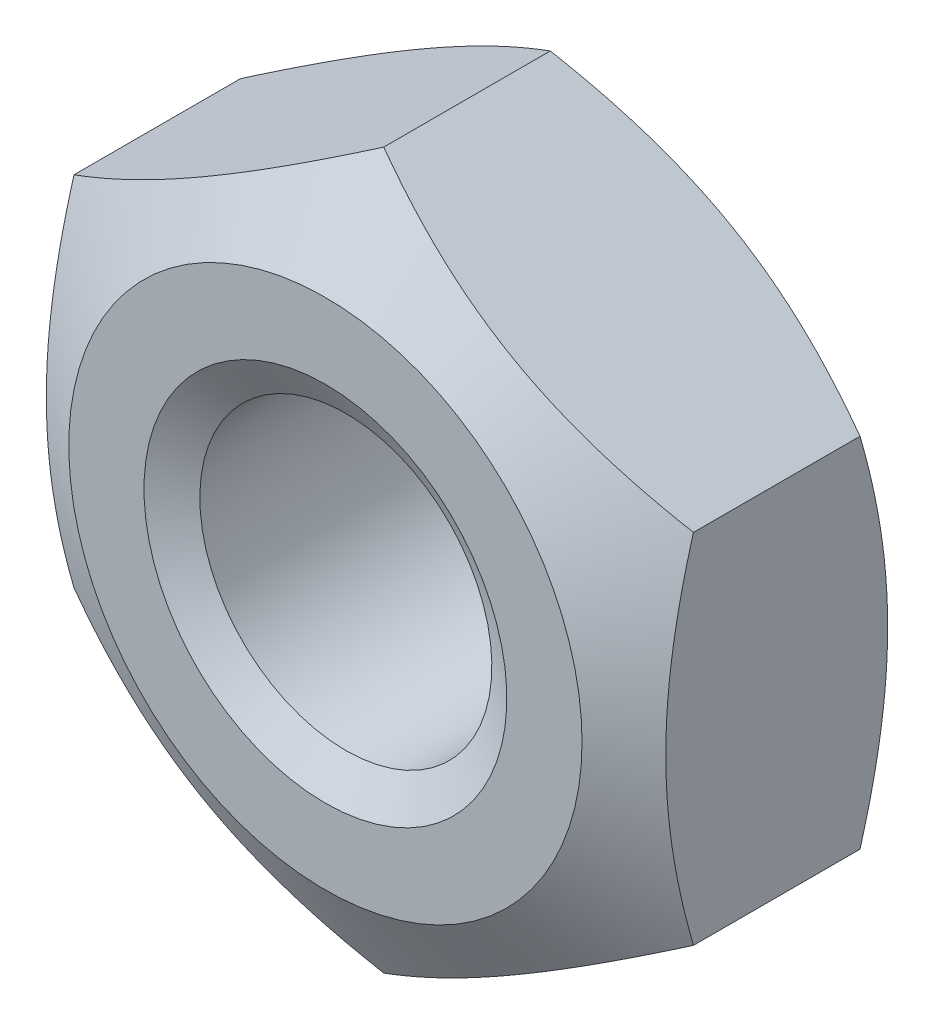
ISO-10303-21;
HEADER;
FILE_DESCRIPTION(('STEP AP214'),'2;1');
FILE_NAME('part.step','',(''),(''),'','','');
FILE_SCHEMA(('AUTOMOTIVE_DESIGN { 1 0 10303 214 1 1 1 1 }'));
ENDSEC;
DATA;
#1=APPLICATION_CONTEXT('core data for automotive mechanical design processes');
#2=APPLICATION_PROTOCOL_DEFINITION('international standard','automotive_design',2000,#1);
#3=PRODUCT_CONTEXT('',#1,'mechanical');
#4=PRODUCT('Part','Part','',(#3));
#5=PRODUCT_RELATED_PRODUCT_CATEGORY('part','',(#4));
#6=PRODUCT_DEFINITION_FORMATION('','',#4);
#7=PRODUCT_DEFINITION_CONTEXT('part definition',#1,'design');
#8=PRODUCT_DEFINITION('design','',#6,#7);
#9=PRODUCT_DEFINITION_SHAPE('','',#8);
#10=(LENGTH_UNIT() NAMED_UNIT(*) SI_UNIT(.MILLI.,.METRE.));
#11=(NAMED_UNIT(*) PLANE_ANGLE_UNIT() SI_UNIT($,.RADIAN.));
#12=(NAMED_UNIT(*) SI_UNIT($,.STERADIAN.) SOLID_ANGLE_UNIT());
#13=UNCERTAINTY_MEASURE_WITH_UNIT(LENGTH_MEASURE(1.E-05),#10,'distance_accuracy_value','');
#14=(GEOMETRIC_REPRESENTATION_CONTEXT(3) GLOBAL_UNCERTAINTY_ASSIGNED_CONTEXT((#13)) GLOBAL_UNIT_ASSIGNED_CONTEXT((#10,
#11,#12)) REPRESENTATION_CONTEXT('',''));
#15=CARTESIAN_POINT('',(0.,0.,0.));
#16=DIRECTION('',(0.,0.,1.));
#17=DIRECTION('',(1.,0.,0.));
#18=AXIS2_PLACEMENT_3D('',#15,#16,#17);
#19=CARTESIAN_POINT('',(0.,0.,0.));
#20=DIRECTION('',(0.,0.,1.));
#21=DIRECTION('',(1.,0.,0.));
#22=AXIS2_PLACEMENT_3D('',#19,#20,#21);
#23=PLANE('',#22);
#24=CARTESIAN_POINT('',(0.,0.,0.));
#25=DIRECTION('',(0.,0.,1.));
#26=DIRECTION('',(0.,-1.,0.));
#27=AXIS2_PLACEMENT_3D('',#24,#25,#26);
#28=CIRCLE('',#27,2.05);
#29=CARTESIAN_POINT('',(0.,-2.05,0.));
#30=VERTEX_POINT('',#29);
#31=EDGE_CURVE('E265',#30,#30,#28,.T.);
#32=ORIENTED_EDGE('',*,*,#31,.F.);
#33=EDGE_LOOP('',(#32));
#34=FACE_BOUND('',#33,.T.);
#35=CARTESIAN_POINT('',(0.,0.,0.));
#36=DIRECTION('',(0.,0.,1.));
#37=DIRECTION('',(1.,0.,0.));
#38=AXIS2_PLACEMENT_3D('',#35,#36,#37);
#39=CIRCLE('',#38,2.9);
#40=CARTESIAN_POINT('',(2.9,0.,0.));
#41=VERTEX_POINT('',#40);
#42=EDGE_CURVE('E224',#41,#41,#39,.T.);
#43=ORIENTED_EDGE('',*,*,#42,.T.);
#44=EDGE_LOOP('',(#43));
#45=FACE_BOUND('',#44,.T.);
#46=ADVANCED_FACE('F37',(#34,#45),#23,.T.);
#47=CARTESIAN_POINT('',(0.,0.,0.));
#48=DIRECTION('',(0.,0.,-1.));
#49=DIRECTION('',(-1.,0.,0.));
#50=AXIS2_PLACEMENT_3D('',#47,#48,#49);
#51=CONICAL_SURFACE('',#50,2.9,1.0471975511966);
#52=CARTESIAN_POINT('',(-3.50020000000001,2.02061047210984,-0.659084222207149));
#53=CARTESIAN_POINT('',(-3.34639282154756,2.10941108799266,-0.607795950503762));
#54=CARTESIAN_POINT('',(-3.19125798916559,2.19897822522908,-0.561151115329975));
#55=CARTESIAN_POINT('',(-2.87830199342323,2.37966345361544,-0.479732037047126));
#56=CARTESIAN_POINT('',(-2.72047526921251,2.47078475532381,-0.444986597098339));
#57=CARTESIAN_POINT('',(-2.40677778961988,2.65189807961073,-0.390900188696613));
#58=CARTESIAN_POINT('',(-2.25095530083932,2.74186223545398,-0.371199247774158));
#59=CARTESIAN_POINT('',(-1.93857711279464,2.92221386641055,-0.34768029425103));
#60=CARTESIAN_POINT('',(-1.78202254896578,3.01260068598001,-0.343842806059341));
#61=CARTESIAN_POINT('',(-1.48949078007902,3.18149398149329,-0.351825463390753));
#62=CARTESIAN_POINT('',(-1.3534697875421,3.26002573814992,-0.361685595583383));
#63=CARTESIAN_POINT('',(-1.08231397971102,3.41657761679353,-0.392936628413179));
#64=CARTESIAN_POINT('',(-0.947180102315328,3.49459719728457,-0.414338204799573));
#65=CARTESIAN_POINT('',(-0.675465207594828,3.65147186489428,-0.467840569394352));
#66=CARTESIAN_POINT('',(-0.538918580721677,3.73030709667643,-0.500168155958861));
#67=CARTESIAN_POINT('',(-0.267861907055511,3.88680174018324,-0.573539095321768));
#68=CARTESIAN_POINT('',(-0.133348387531477,3.96446315689008,-0.614565208083641));
#69=CARTESIAN_POINT('',(0.000199999999986187,4.04156735438121,-0.659084222207145));
#70=B_SPLINE_CURVE_WITH_KNOTS('',3,(#52,#53,#54,#55,#56,#57,#58,#59,#60,#61,#62,#63,#64,#65,#66,
#67,#68,#69),.UNSPECIFIED.,.F.,.F.,(4,2,2,2,2,2,2,2,4),(0.,0.554793832886255,1.11092123814984,
1.65328467083219,2.19498204478403,2.6666513085086,3.13875761298267,3.6213361260051,
4.10296698719187),.UNSPECIFIED.);
#71=CARTESIAN_POINT('',(-3.5,2.02072594216369,-0.659017552683417));
#72=VERTEX_POINT('',#71);
#73=CARTESIAN_POINT('',(0.,4.04145188432738,-0.659017552683417));
#74=VERTEX_POINT('',#73);
#75=EDGE_CURVE('E219',#72,#74,#70,.T.);
#76=ORIENTED_EDGE('',*,*,#75,.F.);
#77=CARTESIAN_POINT('',(-3.50000000000001,-5.31136483673784,-1.99813101628422));
#78=CARTESIAN_POINT('',(-3.50000000000001,-5.15942090242245,-1.92490121468986));
#79=CARTESIAN_POINT('',(-3.50000000000001,-5.00711533370036,-1.85240822887569));
#80=CARTESIAN_POINT('',(-3.50000000000001,-4.70158810322329,-1.70931288720086));
#81=CARTESIAN_POINT('',(-3.50000000000001,-4.54836629015752,-1.63871085479051));
#82=CARTESIAN_POINT('',(-3.50000000000001,-4.23996688822228,-1.4994338768294));
#83=CARTESIAN_POINT('',(-3.50000000000001,-4.08478310281085,-1.43077260224771));
#84=CARTESIAN_POINT('',(-3.50000000000001,-3.77313949355462,-1.29642081556093));
#85=CARTESIAN_POINT('',(-3.50000000000001,-3.61667973418189,-1.23073015444182));
#86=CARTESIAN_POINT('',(-3.50000000000001,-3.29768531174892,-1.10126128807796));
#87=CARTESIAN_POINT('',(-3.50000000000001,-3.13510572183041,-1.03759314345185));
#88=CARTESIAN_POINT('',(-3.50000000000001,-2.80800197247078,-0.915364021417356));
#89=CARTESIAN_POINT('',(-3.50000000000001,-2.64347759131592,-0.856803632815379));
#90=CARTESIAN_POINT('',(-3.50000000000001,-2.31257010807294,-0.74641323862502));
#91=CARTESIAN_POINT('',(-3.50000000000001,-2.14619196139842,-0.694568534709308));
#92=CARTESIAN_POINT('',(-3.50000000000001,-1.81105343313581,-0.599349171371076));
#93=CARTESIAN_POINT('',(-3.50000000000001,-1.64229385723014,-0.555971717651678));
#94=CARTESIAN_POINT('',(-3.50000000000001,-1.30319521232889,-0.480063371355623));
#95=CARTESIAN_POINT('',(-3.50000000000001,-1.13286830203993,-0.447479195842798));
#96=CARTESIAN_POINT('',(-3.50000000000001,-0.79022477286612,-0.395081871657864));
#97=CARTESIAN_POINT('',(-3.50000000000001,-0.617908307087577,-0.37526774684645));
#98=CARTESIAN_POINT('',(-3.50000000000001,-0.274345197192189,-0.350251362238807));
#99=CARTESIAN_POINT('',(-3.50000000000001,-0.103111880555402,-0.344870531201222));
#100=CARTESIAN_POINT('',(-3.50000000000001,0.239201330874601,-0.348713485586125));
#101=CARTESIAN_POINT('',(-3.50000000000001,0.41028121928658,-0.357937852613651));
#102=CARTESIAN_POINT('',(-3.50000000000001,0.70429519265999,-0.385707915406696));
#103=CARTESIAN_POINT('',(-3.50000000000001,0.827552756549975,-0.400999335346644));
#104=CARTESIAN_POINT('',(-3.50000000000001,1.073081965004,-0.438145456330363));
#105=CARTESIAN_POINT('',(-3.50000000000001,1.19535345727716,-0.460001151969546));
#106=CARTESIAN_POINT('',(-3.50000000000001,1.56057228529969,-0.53425672689792));
#107=CARTESIAN_POINT('',(-3.50000000000001,1.80177155667069,-0.595328878881682));
#108=CARTESIAN_POINT('',(-3.50000000000001,2.16232569526209,-0.70017140308527));
#109=CARTESIAN_POINT('',(-3.50000000000001,2.28357348756094,-0.737793809790581));
#110=CARTESIAN_POINT('',(-3.50000000000001,2.52489010665731,-0.816679840125424));
#111=CARTESIAN_POINT('',(-3.50000000000001,2.64495892581726,-0.857943487326186));
#112=CARTESIAN_POINT('',(-3.50000000000001,2.88396125133164,-0.943472145917674));
#113=CARTESIAN_POINT('',(-3.50000000000001,3.00289517396904,-0.987736004433427));
#114=CARTESIAN_POINT('',(-3.50000000000001,3.23979550184552,-1.07877130209366));
#115=CARTESIAN_POINT('',(-3.50000000000001,3.35776191637186,-1.12554271713519));
#116=CARTESIAN_POINT('',(-3.50000000000001,3.62720966858019,-1.23515214584308));
#117=CARTESIAN_POINT('',(-3.50000000000001,3.77840595445805,-1.29868951541557));
#118=CARTESIAN_POINT('',(-3.50000000000001,4.07960382759664,-1.42854148860491));
#119=CARTESIAN_POINT('',(-3.50000000000001,4.22960535759355,-1.49485622439695));
#120=CARTESIAN_POINT('',(-3.50000000000001,4.67815880312762,-1.6971372832275));
#121=CARTESIAN_POINT('',(-3.50000000000001,4.97521308173916,-1.83642112459514));
#122=CARTESIAN_POINT('',(-3.50000000000001,5.56674529590108,-2.12094682913322));
#123=CARTESIAN_POINT('',(-3.50000000000001,5.86122075568393,-2.26619378792242));
#124=CARTESIAN_POINT('',(-3.50000000000001,6.44813760950686,-2.56075420943249));
#125=CARTESIAN_POINT('',(-3.50000000000001,6.74057893842578,-2.71006780159818));
#126=CARTESIAN_POINT('',(-3.50000000000001,7.30109720136647,-2.99978756420686));
#127=CARTESIAN_POINT('',(-3.50000000000001,7.56928762666126,-3.1399748724395));
#128=CARTESIAN_POINT('',(-3.50000000000001,8.10469000797172,-3.42222223815564));
#129=CARTESIAN_POINT('',(-3.50000000000001,8.37190193564299,-3.56428234934926));
#130=CARTESIAN_POINT('',(-3.50000000000001,8.90498527599219,-3.84953363937058));
#131=CARTESIAN_POINT('',(-3.50000000000001,9.17085833346865,-3.99272174872152));
#132=CARTESIAN_POINT('',(-3.50000000000001,9.70197403805375,-4.2802329515213));
#133=CARTESIAN_POINT('',(-3.50000000000001,9.96721671443289,-4.424555990876));
#134=CARTESIAN_POINT('',(-3.50000000000001,10.2322248103912,-4.56930561963763));
#135=B_SPLINE_CURVE_WITH_KNOTS('',3,(#77,#78,#79,#80,#81,#82,#83,#84,#85,#86,#87,#88,#89,#90,
#91,#92,#93,#94,#95,#96,#97,#98,#99,#100,#101,#102,#103,#104,#105,#106,#107,#108,#109,#110,#111,
#112,#113,#114,#115,#116,#117,#118,#119,#120,#121,#122,#123,#124,#125,#126,#127,#128,#129,#130,
#131,#132,#133,#134),.UNSPECIFIED.,.F.,.F.,(4,2,2,2,2,2,2,2,2,2,2,2,2,2,2,2,2,2,2,2,2,2,2,2,2,2,
2,2,4),(0.,0.506016733737126,1.01211947662582,1.52117948842461,2.03021393600136,
2.55395280437168,3.07775196817206,3.60038461534117,4.12284449461688,4.64268532226538,
5.16248640870381,5.67582610483066,6.18918624357403,6.5616107275697,6.93409166847294,
7.67951132389959,8.0603346603271,8.44116046215974,8.82184074678616,9.20251737292057,
9.69449258724899,10.1864912414024,11.1706395360279,12.1556470640961,13.1406859826261,
14.0485359547554,14.9564120200025,15.8623460587302,16.7682371765389),.UNSPECIFIED.);
#136=CARTESIAN_POINT('',(-3.50000000000001,-2.02072594216367,-0.659017552683417));
#137=VERTEX_POINT('',#136);
#138=EDGE_CURVE('E187',#137,#72,#135,.T.);
#139=ORIENTED_EDGE('',*,*,#138,.F.);
#140=CARTESIAN_POINT('',(0.000199999999984311,-4.04156735438123,-0.659084222207153));
#141=CARTESIAN_POINT('',(-0.153607178452466,-3.95276673849841,-0.607795950503765));
#142=CARTESIAN_POINT('',(-0.308742010834441,-3.86319960126199,-0.561151115329979));
#143=CARTESIAN_POINT('',(-0.6216980065768,-3.68251437287563,-0.479732037047132));
#144=CARTESIAN_POINT('',(-0.779524730787515,-3.59139307116726,-0.444986597098345));
#145=CARTESIAN_POINT('',(-1.09322221038015,-3.41027974688035,-0.39090018869662));
#146=CARTESIAN_POINT('',(-1.24904469916071,-3.32031559103709,-0.371199247774166));
#147=CARTESIAN_POINT('',(-1.5614228872054,-3.13996396008052,-0.34768029425104));
#148=CARTESIAN_POINT('',(-1.71797745103425,-3.04957714051107,-0.343842806059352));
#149=CARTESIAN_POINT('',(-2.01050921992101,-2.88068384499778,-0.351825463390765));
#150=CARTESIAN_POINT('',(-2.14653021245793,-2.80215208834115,-0.361685595583395));
#151=CARTESIAN_POINT('',(-2.41768602028901,-2.64560020969755,-0.392936628413191));
#152=CARTESIAN_POINT('',(-2.5528198976847,-2.56758062920651,-0.414338204799586));
#153=CARTESIAN_POINT('',(-2.8245347924052,-2.4107059615968,-0.467840569394365));
#154=CARTESIAN_POINT('',(-2.96108141927835,-2.33187072981465,-0.500168155958875));
#155=CARTESIAN_POINT('',(-3.23213809294451,-2.17537608630785,-0.573539095321781));
#156=CARTESIAN_POINT('',(-3.36665161246855,-2.097714669601,-0.614565208083653));
#157=CARTESIAN_POINT('',(-3.50020000000001,-2.02061047210987,-0.659084222207157));
#158=B_SPLINE_CURVE_WITH_KNOTS('',3,(#140,#141,#142,#143,#144,#145,#146,#147,#148,#149,#150,
#151,#152,#153,#154,#155,#156,#157),.UNSPECIFIED.,.F.,.F.,(4,2,2,2,2,2,2,2,4),(0.,
0.554793832886256,1.11092123814984,1.65328467083219,2.19498204478404,2.6666513085086,
3.13875761298267,3.62133612600509,4.10296698719186),.UNSPECIFIED.);
#159=CARTESIAN_POINT('',(0.,-4.04145188432738,-0.659017552683417));
#160=VERTEX_POINT('',#159);
#161=EDGE_CURVE('E179',#160,#137,#158,.T.);
#162=ORIENTED_EDGE('',*,*,#161,.F.);
#163=CARTESIAN_POINT('',(3.50019999999999,-2.02061047210986,-0.659084222207145));
#164=CARTESIAN_POINT('',(3.34639282154754,-2.10941108799268,-0.607795950503758));
#165=CARTESIAN_POINT('',(3.19125798916557,-2.1989782252291,-0.561151115329971));
#166=CARTESIAN_POINT('',(2.87830199342321,-2.37966345361546,-0.479732037047124));
#167=CARTESIAN_POINT('',(2.72047526921249,-2.47078475532383,-0.444986597098337));
#168=CARTESIAN_POINT('',(2.40677778961986,-2.65189807961075,-0.390900188696612));
#169=CARTESIAN_POINT('',(2.2509553008393,-2.741862235454,-0.371199247774158));
#170=CARTESIAN_POINT('',(1.93857711279461,-2.92221386641057,-0.347680294251031));
#171=CARTESIAN_POINT('',(1.78202254896576,-3.01260068598002,-0.343842806059342));
#172=CARTESIAN_POINT('',(1.489490780079,-3.18149398149331,-0.351825463390755));
#173=CARTESIAN_POINT('',(1.35346978754208,-3.26002573814994,-0.361685595583385));
#174=CARTESIAN_POINT('',(1.08231397971099,-3.41657761679355,-0.392936628413182));
#175=CARTESIAN_POINT('',(0.947180102315304,-3.49459719728458,-0.414338204799577));
#176=CARTESIAN_POINT('',(0.675465207594802,-3.6514718648943,-0.467840569394357));
#177=CARTESIAN_POINT('',(0.53891858072165,-3.73030709667645,-0.500168155958867));
#178=CARTESIAN_POINT('',(0.267861907055483,-3.88680174018325,-0.573539095321775));
#179=CARTESIAN_POINT('',(0.133348387531448,-3.9644631568901,-0.614565208083648));
#180=CARTESIAN_POINT('',(-0.000200000000015813,-4.04156735438123,-0.659084222207153));
#181=B_SPLINE_CURVE_WITH_KNOTS('',3,(#163,#164,#165,#166,#167,#168,#169,#170,#171,#172,#173,
#174,#175,#176,#177,#178,#179,#180),.UNSPECIFIED.,.F.,.F.,(4,2,2,2,2,2,2,2,4),(0.,
0.554793832886253,1.11092123814984,1.65328467083219,2.19498204478403,2.6666513085086,
3.13875761298267,3.6213361260051,4.10296698719188),.UNSPECIFIED.);
#182=CARTESIAN_POINT('',(3.49999999999999,-2.0207259421637,-0.659017552683417));
#183=VERTEX_POINT('',#182);
#184=EDGE_CURVE('E95',#183,#160,#181,.T.);
#185=ORIENTED_EDGE('',*,*,#184,.F.);
#186=CARTESIAN_POINT('',(3.49999999999999,-5.31136483673782,-1.9981310162842));
#187=CARTESIAN_POINT('',(3.49999999999999,-5.15942090242243,-1.92490121468984));
#188=CARTESIAN_POINT('',(3.49999999999999,-5.00711533370034,-1.85240822887567));
#189=CARTESIAN_POINT('',(3.49999999999999,-4.70158810322327,-1.70931288720084));
#190=CARTESIAN_POINT('',(3.49999999999999,-4.5483662901575,-1.63871085479049));
#191=CARTESIAN_POINT('',(3.49999999999999,-4.23996688822227,-1.49943387682938));
#192=CARTESIAN_POINT('',(3.49999999999999,-4.08478310281084,-1.43077260224769));
#193=CARTESIAN_POINT('',(3.49999999999999,-3.77313949355461,-1.29642081556092));
#194=CARTESIAN_POINT('',(3.49999999999999,-3.61667973418188,-1.23073015444181));
#195=CARTESIAN_POINT('',(3.49999999999999,-3.29768531174891,-1.10126128807795));
#196=CARTESIAN_POINT('',(3.49999999999999,-3.1351057218304,-1.03759314345183));
#197=CARTESIAN_POINT('',(3.49999999999999,-2.80800197247077,-0.915364021417344));
#198=CARTESIAN_POINT('',(3.49999999999999,-2.64347759131591,-0.856803632815367));
#199=CARTESIAN_POINT('',(3.49999999999999,-2.31257010807293,-0.746413238625008));
#200=CARTESIAN_POINT('',(3.49999999999999,-2.14619196139841,-0.694568534709296));
#201=CARTESIAN_POINT('',(3.49999999999999,-1.8110534331358,-0.599349171371064));
#202=CARTESIAN_POINT('',(3.49999999999999,-1.64229385723014,-0.555971717651666));
#203=CARTESIAN_POINT('',(3.49999999999999,-1.30319521232888,-0.480063371355612));
#204=CARTESIAN_POINT('',(3.49999999999999,-1.13286830203993,-0.447479195842786));
#205=CARTESIAN_POINT('',(3.49999999999999,-0.790224772866121,-0.395081871657852));
#206=CARTESIAN_POINT('',(3.49999999999999,-0.617908307087578,-0.375267746846438));
#207=CARTESIAN_POINT('',(3.49999999999999,-0.274345197192193,-0.350251362238795));
#208=CARTESIAN_POINT('',(3.49999999999999,-0.103111880555407,-0.34487053120121));
#209=CARTESIAN_POINT('',(3.49999999999999,0.239201330874594,-0.348713485586112));
#210=CARTESIAN_POINT('',(3.49999999999999,0.410281219286572,-0.357937852613639));
#211=CARTESIAN_POINT('',(3.49999999999999,0.704295192659981,-0.385707915406683));
#212=CARTESIAN_POINT('',(3.49999999999999,0.827552756549966,-0.400999335346631));
#213=CARTESIAN_POINT('',(3.49999999999999,1.07308196500399,-0.438145456330349));
#214=CARTESIAN_POINT('',(3.49999999999999,1.19535345727715,-0.460001151969533));
#215=CARTESIAN_POINT('',(3.49999999999999,1.56057228529967,-0.534256726897906));
#216=CARTESIAN_POINT('',(3.49999999999999,1.80177155667067,-0.595328878881667));
#217=CARTESIAN_POINT('',(3.49999999999999,2.16232569526207,-0.700171403085254));
#218=CARTESIAN_POINT('',(3.49999999999999,2.28357348756092,-0.737793809790564));
#219=CARTESIAN_POINT('',(3.49999999999999,2.52489010665729,-0.816679840125407));
#220=CARTESIAN_POINT('',(3.49999999999999,2.64495892581724,-0.857943487326168));
#221=CARTESIAN_POINT('',(3.49999999999999,2.88396125133162,-0.943472145917656));
#222=CARTESIAN_POINT('',(3.49999999999999,3.00289517396902,-0.987736004433409));
#223=CARTESIAN_POINT('',(3.49999999999999,3.2397955018455,-1.07877130209364));
#224=CARTESIAN_POINT('',(3.49999999999999,3.35776191637183,-1.12554271713517));
#225=CARTESIAN_POINT('',(3.49999999999999,3.62720966858016,-1.23515214584306));
#226=CARTESIAN_POINT('',(3.49999999999999,3.77840595445802,-1.29868951541555));
#227=CARTESIAN_POINT('',(3.49999999999999,4.07960382759661,-1.42854148860489));
#228=CARTESIAN_POINT('',(3.49999999999999,4.22960535759352,-1.49485622439693));
#229=CARTESIAN_POINT('',(3.49999999999999,4.67815880312759,-1.69713728322748));
#230=CARTESIAN_POINT('',(3.49999999999999,4.97521308173913,-1.83642112459512));
#231=CARTESIAN_POINT('',(3.49999999999999,5.56674529590105,-2.12094682913319));
#232=CARTESIAN_POINT('',(3.49999999999999,5.86122075568389,-2.2661937879224));
#233=CARTESIAN_POINT('',(3.49999999999999,6.44813760950683,-2.56075420943246));
#234=CARTESIAN_POINT('',(3.49999999999999,6.74057893842575,-2.71006780159815));
#235=CARTESIAN_POINT('',(3.49999999999999,7.30109720136643,-2.99978756420684));
#236=CARTESIAN_POINT('',(3.49999999999999,7.56928762666122,-3.13997487243947));
#237=CARTESIAN_POINT('',(3.49999999999999,8.10469000797167,-3.42222223815561));
#238=CARTESIAN_POINT('',(3.49999999999999,8.37190193564295,-3.56428234934924));
#239=CARTESIAN_POINT('',(3.49999999999999,8.90498527599215,-3.84953363937056));
#240=CARTESIAN_POINT('',(3.49999999999999,9.17085833346861,-3.99272174872149));
#241=CARTESIAN_POINT('',(3.49999999999999,9.70197403805371,-4.28023295152127));
#242=CARTESIAN_POINT('',(3.49999999999999,9.96721671443285,-4.42455599087597));
#243=CARTESIAN_POINT('',(3.49999999999999,10.2322248103912,-4.5693056196376));
#244=B_SPLINE_CURVE_WITH_KNOTS('',3,(#186,#187,#188,#189,#190,#191,#192,#193,#194,#195,#196,
#197,#198,#199,#200,#201,#202,#203,#204,#205,#206,#207,#208,#209,#210,#211,#212,#213,#214,#215,
#216,#217,#218,#219,#220,#221,#222,#223,#224,#225,#226,#227,#228,#229,#230,#231,#232,#233,#234,
#235,#236,#237,#238,#239,#240,#241,#242,#243),.UNSPECIFIED.,.F.,.F.,(4,2,2,2,2,2,2,2,2,2,2,2,2,
2,2,2,2,2,2,2,2,2,2,2,2,2,2,2,4),(0.,0.506016733737123,1.01211947662581,1.52117948842461,
2.03021393600135,2.55395280437166,3.07775196817205,3.60038461534115,4.12284449461685,
4.64268532226536,5.16248640870378,5.67582610483063,6.18918624357399,6.56161072756967,
6.9340916684729,7.67951132389954,8.06033466032706,8.44116046215969,8.82184074678611,
9.20251737292051,9.69449258724894,10.1864912414023,11.1706395360279,12.1556470640961,
13.1406859826261,14.0485359547554,14.9564120200024,15.8623460587302,16.7682371765388),.UNSPECIFIED.);
#245=CARTESIAN_POINT('',(3.49999999999999,2.0207259421637,-0.659017552683417));
#246=VERTEX_POINT('',#245);
#247=EDGE_CURVE('E91',#246,#183,#244,.F.);
#248=ORIENTED_EDGE('',*,*,#247,.F.);
#249=CARTESIAN_POINT('',(-0.000200000000013974,4.04156735438121,-0.659084222207144));
#250=CARTESIAN_POINT('',(0.153607178452435,3.9527667384984,-0.607795950503756));
#251=CARTESIAN_POINT('',(0.308742010834409,3.86319960126198,-0.561151115329969));
#252=CARTESIAN_POINT('',(0.621698006576766,3.68251437287562,-0.47973203704712));
#253=CARTESIAN_POINT('',(0.77952473078748,3.59139307116724,-0.444986597098332));
#254=CARTESIAN_POINT('',(1.09322221038011,3.41027974688033,-0.390900188696605));
#255=CARTESIAN_POINT('',(1.24904469916067,3.32031559103707,-0.37119924777415));
#256=CARTESIAN_POINT('',(1.56142288720536,3.13996396008051,-0.347680294251022));
#257=CARTESIAN_POINT('',(1.71797745103421,3.04957714051105,-0.343842806059332));
#258=CARTESIAN_POINT('',(2.01050921992097,2.88068384499777,-0.351825463390744));
#259=CARTESIAN_POINT('',(2.14653021245789,2.80215208834114,-0.361685595583373));
#260=CARTESIAN_POINT('',(2.41768602028898,2.64560020969752,-0.392936628413169));
#261=CARTESIAN_POINT('',(2.55281989768467,2.56758062920649,-0.414338204799563));
#262=CARTESIAN_POINT('',(2.82453479240517,2.41070596159677,-0.467840569394342));
#263=CARTESIAN_POINT('',(2.96108141927832,2.33187072981462,-0.500168155958852));
#264=CARTESIAN_POINT('',(3.23213809294449,2.17537608630781,-0.57353909532176));
#265=CARTESIAN_POINT('',(3.36665161246853,2.09771466960097,-0.614565208083633));
#266=CARTESIAN_POINT('',(3.50019999999999,2.02061047210984,-0.659084222207137));
#267=B_SPLINE_CURVE_WITH_KNOTS('',3,(#249,#250,#251,#252,#253,#254,#255,#256,#257,#258,#259,
#260,#261,#262,#263,#264,#265,#266),.UNSPECIFIED.,.F.,.F.,(4,2,2,2,2,2,2,2,4),(0.,
0.554793832886253,1.11092123814984,1.65328467083219,2.19498204478403,2.6666513085086,
3.13875761298268,3.6213361260051,4.10296698719188),.UNSPECIFIED.);
#268=EDGE_CURVE('E63',#74,#246,#267,.T.);
#269=ORIENTED_EDGE('',*,*,#268,.F.);
#270=EDGE_LOOP('',(#76,#139,#162,#185,#248,#269));
#271=FACE_BOUND('',#270,.T.);
#272=ORIENTED_EDGE('',*,*,#42,.F.);
#273=EDGE_LOOP('',(#272));
#274=FACE_BOUND('',#273,.T.);
#275=ADVANCED_FACE('F92',(#271,#274),#51,.T.);
#276=CARTESIAN_POINT('',(3.49999999999999,2.02072594216367,-3.2));
#277=DIRECTION('',(0.500000000000002,0.866025403784438,0.));
#278=DIRECTION('',(-0.866025403784438,0.500000000000002,0.));
#279=AXIS2_PLACEMENT_3D('',#276,#277,#278);
#280=PLANE('',#279);
#281=DIRECTION('',(0.,0.,1.));
#282=VECTOR('',#281,1.);
#283=CARTESIAN_POINT('',(3.49999999999999,2.02072594216367,-3.2));
#284=LINE('',#283,#282);
#285=CARTESIAN_POINT('',(3.49999999999999,2.0207259421637,-2.54098244731659));
#286=VERTEX_POINT('',#285);
#287=EDGE_CURVE('E11',#286,#246,#284,.T.);
#288=ORIENTED_EDGE('',*,*,#287,.F.);
#289=CARTESIAN_POINT('',(3.50019999999999,2.02061047210984,-2.54091577779287));
#290=CARTESIAN_POINT('',(3.34639282154754,2.10941108799265,-2.59220404949626));
#291=CARTESIAN_POINT('',(3.19125798916557,2.19897822522907,-2.63884888467004));
#292=CARTESIAN_POINT('',(2.87830199342321,2.37966345361543,-2.72026796295289));
#293=CARTESIAN_POINT('',(2.7204752692125,2.4707847553238,-2.75501340290168));
#294=CARTESIAN_POINT('',(2.40677778961987,2.65189807961072,-2.8090998113034));
#295=CARTESIAN_POINT('',(2.25095530083931,2.74186223545397,-2.82880075222585));
#296=CARTESIAN_POINT('',(1.93857711279463,2.92221386641054,-2.85231970574898));
#297=CARTESIAN_POINT('',(1.78202254896577,3.01260068597999,-2.85615719394067));
#298=CARTESIAN_POINT('',(1.48949078007901,3.18149398149328,-2.84817453660926));
#299=CARTESIAN_POINT('',(1.35346978754209,3.26002573814991,-2.83831440441663));
#300=CARTESIAN_POINT('',(1.082313979711,3.41657761679352,-2.80706337158683));
#301=CARTESIAN_POINT('',(0.947180102315313,3.49459719728456,-2.78566179520044));
#302=CARTESIAN_POINT('',(0.67546520759481,3.65147186489428,-2.73215943060566));
#303=CARTESIAN_POINT('',(0.538918580721657,3.73030709667643,-2.69983184404115));
#304=CARTESIAN_POINT('',(0.267861907055488,3.88680174018323,-2.62646090467824));
#305=CARTESIAN_POINT('',(0.133348387531451,3.96446315689008,-2.58543479191637));
#306=CARTESIAN_POINT('',(-0.000200000000013673,4.04156735438121,-2.54091577779286));
#307=B_SPLINE_CURVE_WITH_KNOTS('',3,(#289,#290,#291,#292,#293,#294,#295,#296,#297,#298,#299,
#300,#301,#302,#303,#304,#305,#306),.UNSPECIFIED.,.F.,.F.,(4,2,2,2,2,2,2,2,4),(0.,
0.55479383288625,1.11092123814983,1.65328467083218,2.19498204478402,2.66665130850859,
3.13875761298267,3.6213361260051,4.10296698719188),.UNSPECIFIED.);
#308=CARTESIAN_POINT('',(0.,4.04145188432738,-2.54098244731659));
#309=VERTEX_POINT('',#308);
#310=EDGE_CURVE('E111',#286,#309,#307,.T.);
#311=ORIENTED_EDGE('',*,*,#310,.T.);
#312=DIRECTION('',(0.,0.,1.));
#313=VECTOR('',#312,1.);
#314=CARTESIAN_POINT('',(0.,4.04145188432738,-3.2));
#315=LINE('',#314,#313);
#316=EDGE_CURVE('E42',#309,#74,#315,.T.);
#317=ORIENTED_EDGE('',*,*,#316,.T.);
#318=ORIENTED_EDGE('',*,*,#268,.T.);
#319=EDGE_LOOP('',(#288,#311,#317,#318));
#320=FACE_BOUND('',#319,.T.);
#321=ADVANCED_FACE('F39',(#320),#280,.T.);
#322=CARTESIAN_POINT('',(3.49999999999999,-2.0207259421637,-3.2));
#323=DIRECTION('',(1.,0.,0.));
#324=DIRECTION('',(0.,0.,-1.));
#325=AXIS2_PLACEMENT_3D('',#322,#323,#324);
#326=PLANE('',#325);
#327=DIRECTION('',(0.,0.,1.));
#328=VECTOR('',#327,1.);
#329=CARTESIAN_POINT('',(3.49999999999999,-2.0207259421637,-3.2));
#330=LINE('',#329,#328);
#331=CARTESIAN_POINT('',(3.49999999999999,-2.0207259421637,-2.54098244731659));
#332=VERTEX_POINT('',#331);
#333=EDGE_CURVE('E47',#332,#183,#330,.T.);
#334=ORIENTED_EDGE('',*,*,#333,.F.);
#335=CARTESIAN_POINT('',(3.49999999999999,-5.31136483673782,-1.20186898371583));
#336=CARTESIAN_POINT('',(3.49999999999999,-5.15942090242243,-1.27509878531019));
#337=CARTESIAN_POINT('',(3.49999999999999,-5.00711533370034,-1.34759177112436));
#338=CARTESIAN_POINT('',(3.49999999999999,-4.70158810322327,-1.49068711279919));
#339=CARTESIAN_POINT('',(3.49999999999999,-4.5483662901575,-1.56128914520953));
#340=CARTESIAN_POINT('',(3.49999999999999,-4.23996688822227,-1.70056612317064));
#341=CARTESIAN_POINT('',(3.49999999999999,-4.08478310281084,-1.76922739775233));
#342=CARTESIAN_POINT('',(3.49999999999999,-3.77313949355461,-1.9035791844391));
#343=CARTESIAN_POINT('',(3.49999999999999,-3.61667973418188,-1.96926984555821));
#344=CARTESIAN_POINT('',(3.49999999999999,-3.29768531174891,-2.09873871192207));
#345=CARTESIAN_POINT('',(3.49999999999999,-3.1351057218304,-2.16240685654818));
#346=CARTESIAN_POINT('',(3.49999999999999,-2.80800197247078,-2.28463597858267));
#347=CARTESIAN_POINT('',(3.49999999999999,-2.64347759131591,-2.34319636718464));
#348=CARTESIAN_POINT('',(3.49999999999999,-2.31257010807293,-2.453586761375));
#349=CARTESIAN_POINT('',(3.49999999999999,-2.14619196139842,-2.50543146529071));
#350=CARTESIAN_POINT('',(3.49999999999999,-1.8110534331358,-2.60065082862894));
#351=CARTESIAN_POINT('',(3.49999999999999,-1.64229385723014,-2.64402828234834));
#352=CARTESIAN_POINT('',(3.49999999999999,-1.30319521232889,-2.71993662864439));
#353=CARTESIAN_POINT('',(3.49999999999999,-1.13286830203993,-2.75252080415722));
#354=CARTESIAN_POINT('',(3.49999999999999,-0.790224772866123,-2.80491812834215));
#355=CARTESIAN_POINT('',(3.49999999999999,-0.617908307087581,-2.82473225315356));
#356=CARTESIAN_POINT('',(3.49999999999999,-0.274345197192197,-2.84974863776121));
#357=CARTESIAN_POINT('',(3.49999999999999,-0.103111880555412,-2.85512946879879));
#358=CARTESIAN_POINT('',(3.49999999999999,0.239201330874588,-2.85128651441389));
#359=CARTESIAN_POINT('',(3.49999999999999,0.410281219286565,-2.84206214738636));
#360=CARTESIAN_POINT('',(3.49999999999999,0.704295192659977,-2.81429208459332));
#361=CARTESIAN_POINT('',(3.49999999999999,0.827552756549964,-2.79900066465337));
#362=CARTESIAN_POINT('',(3.49999999999999,1.07308196500399,-2.76185454366965));
#363=CARTESIAN_POINT('',(3.49999999999999,1.19535345727716,-2.73999884803047));
#364=CARTESIAN_POINT('',(3.49999999999999,1.56057228529969,-2.6657432731021));
#365=CARTESIAN_POINT('',(3.49999999999999,1.80177155667069,-2.60467112111833));
#366=CARTESIAN_POINT('',(3.49999999999999,2.1623256952621,-2.49982859691475));
#367=CARTESIAN_POINT('',(3.49999999999999,2.28357348756095,-2.46220619020943));
#368=CARTESIAN_POINT('',(3.49999999999999,2.52489010665732,-2.38332015987459));
#369=CARTESIAN_POINT('',(3.49999999999999,2.64495892581728,-2.34205651267383));
#370=CARTESIAN_POINT('',(3.49999999999999,2.88396125133166,-2.25652785408234));
#371=CARTESIAN_POINT('',(3.49999999999999,3.00289517396906,-2.21226399556659));
#372=CARTESIAN_POINT('',(3.49999999999999,3.23979550184555,-2.12122869790635));
#373=CARTESIAN_POINT('',(3.49999999999999,3.35776191637188,-2.07445728286483));
#374=CARTESIAN_POINT('',(3.49999999999999,3.62720966858022,-1.96484785415694));
#375=CARTESIAN_POINT('',(3.49999999999999,3.77840595445808,-1.90131048458444));
#376=CARTESIAN_POINT('',(3.49999999999999,4.07960382759667,-1.77145851139511));
#377=CARTESIAN_POINT('',(3.49999999999999,4.22960535759358,-1.70514377560307));
#378=CARTESIAN_POINT('',(3.49999999999999,4.67815880312765,-1.50286271677252));
#379=CARTESIAN_POINT('',(3.49999999999999,4.97521308173919,-1.36357887540489));
#380=CARTESIAN_POINT('',(3.49999999999999,5.56674529590111,-1.07905317086681));
#381=CARTESIAN_POINT('',(3.49999999999999,5.86122075568395,-0.933806212077608));
#382=CARTESIAN_POINT('',(3.49999999999999,6.44813760950689,-0.639245790567549));
#383=CARTESIAN_POINT('',(3.49999999999999,6.74057893842581,-0.48993219840186));
#384=CARTESIAN_POINT('',(3.49999999999999,7.30109720136649,-0.200212435793185));
#385=CARTESIAN_POINT('',(3.49999999999999,7.56928762666129,-0.0600251275605518));
#386=CARTESIAN_POINT('',(3.49999999999999,8.10469000797174,0.222222238155584));
#387=CARTESIAN_POINT('',(3.49999999999999,8.37190193564302,0.364282349349208));
#388=CARTESIAN_POINT('',(3.49999999999999,8.90498527599222,0.649533639370524));
#389=CARTESIAN_POINT('',(3.49999999999999,9.17085833346868,0.792721748721453));
#390=CARTESIAN_POINT('',(3.49999999999999,9.70197403805377,1.08023295152123));
#391=CARTESIAN_POINT('',(3.49999999999999,9.96721671443292,1.22455599087592));
#392=CARTESIAN_POINT('',(3.49999999999999,10.2322248103912,1.36930561963756));
#393=B_SPLINE_CURVE_WITH_KNOTS('',3,(#335,#336,#337,#338,#339,#340,#341,#342,#343,#344,#345,
#346,#347,#348,#349,#350,#351,#352,#353,#354,#355,#356,#357,#358,#359,#360,#361,#362,#363,#364,
#365,#366,#367,#368,#369,#370,#371,#372,#373,#374,#375,#376,#377,#378,#379,#380,#381,#382,#383,
#384,#385,#386,#387,#388,#389,#390,#391,#392),.UNSPECIFIED.,.F.,.F.,(4,2,2,2,2,2,2,2,2,2,2,2,2,
2,2,2,2,2,2,2,2,2,2,2,2,2,2,2,4),(0.,0.506016733737121,1.01211947662581,1.5211794884246,
2.03021393600134,2.55395280437166,3.07775196817204,3.60038461534114,4.12284449461684,
4.64268532226535,5.16248640870377,5.67582610483062,6.18918624357398,6.56161072756966,
6.93409166847291,7.67951132389956,8.06033466032708,8.44116046215972,8.82184074678614,
9.20251737292056,9.69449258724899,10.1864912414023,11.1706395360279,12.1556470640961,
13.1406859826261,14.0485359547554,14.9564120200025,15.8623460587302,16.7682371765389),.UNSPECIFIED.);
#394=EDGE_CURVE('E109',#332,#286,#393,.T.);
#395=ORIENTED_EDGE('',*,*,#394,.T.);
#396=ORIENTED_EDGE('',*,*,#287,.T.);
#397=ORIENTED_EDGE('',*,*,#247,.T.);
#398=EDGE_LOOP('',(#334,#395,#396,#397));
#399=FACE_BOUND('',#398,.T.);
#400=ADVANCED_FACE('F108',(#399),#326,.T.);
#401=CARTESIAN_POINT('',(0.,-4.04145188432739,-3.2));
#402=DIRECTION('',(0.499999999999999,-0.866025403784439,0.));
#403=DIRECTION('',(0.866025403784439,0.499999999999999,0.));
#404=AXIS2_PLACEMENT_3D('',#401,#402,#403);
#405=PLANE('',#404);
#406=DIRECTION('',(0.,0.,1.));
#407=VECTOR('',#406,1.);
#408=CARTESIAN_POINT('',(0.,-4.04145188432739,-3.2));
#409=LINE('',#408,#407);
#410=CARTESIAN_POINT('',(0.,-4.04145188432738,-2.54098244731659));
#411=VERTEX_POINT('',#410);
#412=EDGE_CURVE('E208',#411,#160,#409,.T.);
#413=ORIENTED_EDGE('',*,*,#412,.F.);
#414=CARTESIAN_POINT('',(-0.000200000000015813,-4.04156735438123,-2.54091577779285));
#415=CARTESIAN_POINT('',(0.153607178452434,-3.95276673849841,-2.59220404949624));
#416=CARTESIAN_POINT('',(0.308742010834408,-3.86319960126199,-2.63884888467003));
#417=CARTESIAN_POINT('',(0.621698006576766,-3.68251437287563,-2.72026796295287));
#418=CARTESIAN_POINT('',(0.779524730787481,-3.59139307116726,-2.75501340290166));
#419=CARTESIAN_POINT('',(1.09322221038011,-3.41027974688035,-2.80909981130339));
#420=CARTESIAN_POINT('',(1.24904469916068,-3.32031559103709,-2.82880075222584));
#421=CARTESIAN_POINT('',(1.56142288720536,-3.13996396008053,-2.85231970574897));
#422=CARTESIAN_POINT('',(1.71797745103422,-3.04957714051107,-2.85615719394066));
#423=CARTESIAN_POINT('',(2.01050921992098,-2.88068384499778,-2.84817453660925));
#424=CARTESIAN_POINT('',(2.14653021245789,-2.80215208834116,-2.83831440441662));
#425=CARTESIAN_POINT('',(2.41768602028898,-2.64560020969755,-2.80706337158682));
#426=CARTESIAN_POINT('',(2.55281989768467,-2.56758062920651,-2.78566179520043));
#427=CARTESIAN_POINT('',(2.82453479240517,-2.4107059615968,-2.73215943060565));
#428=CARTESIAN_POINT('',(2.96108141927832,-2.33187072981465,-2.69983184404114));
#429=CARTESIAN_POINT('',(3.23213809294449,-2.17537608630784,-2.62646090467824));
#430=CARTESIAN_POINT('',(3.36665161246853,-2.09771466960099,-2.58543479191637));
#431=CARTESIAN_POINT('',(3.50019999999999,-2.02061047210986,-2.54091577779286));
#432=B_SPLINE_CURVE_WITH_KNOTS('',3,(#414,#415,#416,#417,#418,#419,#420,#421,#422,#423,#424,
#425,#426,#427,#428,#429,#430,#431),.UNSPECIFIED.,.F.,.F.,(4,2,2,2,2,2,2,2,4),(0.,
0.554793832886253,1.11092123814984,1.65328467083219,2.19498204478403,2.6666513085086,
3.13875761298267,3.6213361260051,4.10296698719187),.UNSPECIFIED.);
#433=EDGE_CURVE('E112',#411,#332,#432,.T.);
#434=ORIENTED_EDGE('',*,*,#433,.T.);
#435=ORIENTED_EDGE('',*,*,#333,.T.);
#436=ORIENTED_EDGE('',*,*,#184,.T.);
#437=EDGE_LOOP('',(#413,#434,#435,#436));
#438=FACE_BOUND('',#437,.T.);
#439=ADVANCED_FACE('F173',(#438),#405,.T.);
#440=CARTESIAN_POINT('',(-3.50000000000001,-2.02072594216371,-3.2));
#441=DIRECTION('',(-0.499999999999999,-0.866025403784439,0.));
#442=DIRECTION('',(0.866025403784439,-0.499999999999999,0.));
#443=AXIS2_PLACEMENT_3D('',#440,#441,#442);
#444=PLANE('',#443);
#445=DIRECTION('',(0.,0.,1.));
#446=VECTOR('',#445,1.);
#447=CARTESIAN_POINT('',(-3.50000000000001,-2.02072594216371,-3.2));
#448=LINE('',#447,#446);
#449=CARTESIAN_POINT('',(-3.50000000000001,-2.02072594216367,-2.54098244731659));
#450=VERTEX_POINT('',#449);
#451=EDGE_CURVE('E211',#450,#137,#448,.T.);
#452=ORIENTED_EDGE('',*,*,#451,.F.);
#453=CARTESIAN_POINT('',(-3.50020000000001,-2.02061047210987,-2.54091577779285));
#454=CARTESIAN_POINT('',(-3.34639282154756,-2.10941108799269,-2.59220404949624));
#455=CARTESIAN_POINT('',(-3.19125798916558,-2.19897822522911,-2.63884888467002));
#456=CARTESIAN_POINT('',(-2.87830199342323,-2.37966345361547,-2.72026796295287));
#457=CARTESIAN_POINT('',(-2.72047526921251,-2.47078475532384,-2.75501340290166));
#458=CARTESIAN_POINT('',(-2.40677778961988,-2.65189807961075,-2.80909981130338));
#459=CARTESIAN_POINT('',(-2.25095530083931,-2.74186223545401,-2.82880075222583));
#460=CARTESIAN_POINT('',(-1.93857711279463,-2.92221386641058,-2.85231970574896));
#461=CARTESIAN_POINT('',(-1.78202254896577,-3.01260068598003,-2.85615719394065));
#462=CARTESIAN_POINT('',(-1.48949078007902,-3.18149398149332,-2.84817453660924));
#463=CARTESIAN_POINT('',(-1.3534697875421,-3.26002573814995,-2.83831440441661));
#464=CARTESIAN_POINT('',(-1.08231397971101,-3.41657761679355,-2.80706337158681));
#465=CARTESIAN_POINT('',(-0.947180102315326,-3.49459719728459,-2.78566179520042));
#466=CARTESIAN_POINT('',(-0.675465207594827,-3.6514718648943,-2.73215943060564));
#467=CARTESIAN_POINT('',(-0.538918580721676,-3.73030709667645,-2.69983184404113));
#468=CARTESIAN_POINT('',(-0.267861907055512,-3.88680174018325,-2.62646090467823));
#469=CARTESIAN_POINT('',(-0.133348387531479,-3.9644631568901,-2.58543479191636));
#470=CARTESIAN_POINT('',(0.000199999999984312,-4.04156735438123,-2.54091577779285));
#471=B_SPLINE_CURVE_WITH_KNOTS('',3,(#453,#454,#455,#456,#457,#458,#459,#460,#461,#462,#463,
#464,#465,#466,#467,#468,#469,#470),.UNSPECIFIED.,.F.,.F.,(4,2,2,2,2,2,2,2,4),(0.,
0.554793832886254,1.11092123814984,1.65328467083219,2.19498204478404,2.6666513085086,
3.13875761298267,3.62133612600509,4.10296698719186),.UNSPECIFIED.);
#472=EDGE_CURVE('E115',#450,#411,#471,.T.);
#473=ORIENTED_EDGE('',*,*,#472,.T.);
#474=ORIENTED_EDGE('',*,*,#412,.T.);
#475=ORIENTED_EDGE('',*,*,#161,.T.);
#476=EDGE_LOOP('',(#452,#473,#474,#475));
#477=FACE_BOUND('',#476,.T.);
#478=ADVANCED_FACE('F169',(#477),#444,.T.);
#479=CARTESIAN_POINT('',(-3.50000000000001,2.02072594216368,-3.2));
#480=DIRECTION('',(-1.,0.,0.));
#481=DIRECTION('',(0.,0.,1.));
#482=AXIS2_PLACEMENT_3D('',#479,#480,#481);
#483=PLANE('',#482);
#484=DIRECTION('',(0.,0.,1.));
#485=VECTOR('',#484,1.);
#486=CARTESIAN_POINT('',(-3.50000000000001,2.02072594216368,-3.2));
#487=LINE('',#486,#485);
#488=CARTESIAN_POINT('',(-3.50000000000001,2.02072594216368,-2.54098244731659));
#489=VERTEX_POINT('',#488);
#490=EDGE_CURVE('E214',#489,#72,#487,.T.);
#491=ORIENTED_EDGE('',*,*,#490,.F.);
#492=CARTESIAN_POINT('',(-3.50000000000001,-5.31136483673784,-1.20186898371582));
#493=CARTESIAN_POINT('',(-3.50000000000001,-5.15942090242245,-1.27509878531018));
#494=CARTESIAN_POINT('',(-3.50000000000001,-5.00711533370036,-1.34759177112434));
#495=CARTESIAN_POINT('',(-3.50000000000001,-4.70158810322329,-1.49068711279917));
#496=CARTESIAN_POINT('',(-3.50000000000001,-4.54836629015752,-1.56128914520952));
#497=CARTESIAN_POINT('',(-3.50000000000001,-4.23996688822229,-1.70056612317063));
#498=CARTESIAN_POINT('',(-3.50000000000001,-4.08478310281085,-1.76922739775232));
#499=CARTESIAN_POINT('',(-3.50000000000001,-3.77313949355462,-1.90357918443908));
#500=CARTESIAN_POINT('',(-3.50000000000001,-3.61667973418189,-1.9692698455582));
#501=CARTESIAN_POINT('',(-3.50000000000001,-3.29768531174892,-2.09873871192206));
#502=CARTESIAN_POINT('',(-3.50000000000001,-3.13510572183041,-2.16240685654817));
#503=CARTESIAN_POINT('',(-3.50000000000001,-2.80800197247078,-2.28463597858266));
#504=CARTESIAN_POINT('',(-3.50000000000001,-2.64347759131592,-2.34319636718463));
#505=CARTESIAN_POINT('',(-3.50000000000001,-2.31257010807294,-2.45358676137499));
#506=CARTESIAN_POINT('',(-3.50000000000001,-2.14619196139842,-2.5054314652907));
#507=CARTESIAN_POINT('',(-3.50000000000001,-1.81105343313581,-2.60065082862893));
#508=CARTESIAN_POINT('',(-3.50000000000001,-1.64229385723014,-2.64402828234833));
#509=CARTESIAN_POINT('',(-3.50000000000001,-1.30319521232889,-2.71993662864438));
#510=CARTESIAN_POINT('',(-3.50000000000001,-1.13286830203993,-2.75252080415721));
#511=CARTESIAN_POINT('',(-3.50000000000001,-0.790224772866122,-2.80491812834214));
#512=CARTESIAN_POINT('',(-3.50000000000001,-0.617908307087579,-2.82473225315355));
#513=CARTESIAN_POINT('',(-3.50000000000001,-0.274345197192193,-2.84974863776119));
#514=CARTESIAN_POINT('',(-3.50000000000001,-0.103111880555407,-2.85512946879878));
#515=CARTESIAN_POINT('',(-3.50000000000001,0.239201330874595,-2.85128651441388));
#516=CARTESIAN_POINT('',(-3.50000000000001,0.410281219286573,-2.84206214738635));
#517=CARTESIAN_POINT('',(-3.50000000000001,0.704295192659986,-2.81429208459331));
#518=CARTESIAN_POINT('',(-3.50000000000001,0.827552756549974,-2.79900066465336));
#519=CARTESIAN_POINT('',(-3.50000000000001,1.07308196500401,-2.76185454366964));
#520=CARTESIAN_POINT('',(-3.50000000000001,1.19535345727717,-2.73999884803046));
#521=CARTESIAN_POINT('',(-3.50000000000001,1.5605722852997,-2.66574327310208));
#522=CARTESIAN_POINT('',(-3.50000000000001,1.80177155667071,-2.60467112111832));
#523=CARTESIAN_POINT('',(-3.50000000000001,2.16232569526212,-2.49982859691473));
#524=CARTESIAN_POINT('',(-3.50000000000001,2.28357348756097,-2.46220619020942));
#525=CARTESIAN_POINT('',(-3.50000000000001,2.52489010665735,-2.38332015987457));
#526=CARTESIAN_POINT('',(-3.50000000000001,2.6449589258173,-2.34205651267381));
#527=CARTESIAN_POINT('',(-3.50000000000001,2.88396125133169,-2.25652785408232));
#528=CARTESIAN_POINT('',(-3.50000000000001,3.00289517396909,-2.21226399556657));
#529=CARTESIAN_POINT('',(-3.50000000000001,3.23979550184558,-2.12122869790633));
#530=CARTESIAN_POINT('',(-3.50000000000001,3.35776191637191,-2.07445728286481));
#531=CARTESIAN_POINT('',(-3.50000000000001,3.62720966858025,-1.96484785415692));
#532=CARTESIAN_POINT('',(-3.50000000000001,3.77840595445811,-1.90131048458442));
#533=CARTESIAN_POINT('',(-3.50000000000001,4.0796038275967,-1.77145851139509));
#534=CARTESIAN_POINT('',(-3.50000000000001,4.22960535759361,-1.70514377560305));
#535=CARTESIAN_POINT('',(-3.50000000000001,4.67815880312768,-1.5028627167725));
#536=CARTESIAN_POINT('',(-3.50000000000001,4.97521308173922,-1.36357887540486));
#537=CARTESIAN_POINT('',(-3.50000000000001,5.56674529590114,-1.07905317086679));
#538=CARTESIAN_POINT('',(-3.50000000000001,5.86122075568399,-0.933806212077584));
#539=CARTESIAN_POINT('',(-3.50000000000001,6.44813760950693,-0.639245790567524));
#540=CARTESIAN_POINT('',(-3.50000000000001,6.74057893842585,-0.489932198401835));
#541=CARTESIAN_POINT('',(-3.50000000000001,7.30109720136653,-0.20021243579316));
#542=CARTESIAN_POINT('',(-3.50000000000001,7.56928762666133,-0.0600251275605266));
#543=CARTESIAN_POINT('',(-3.50000000000001,8.10469000797178,0.222222238155611));
#544=CARTESIAN_POINT('',(-3.50000000000001,8.37190193564306,0.364282349349235));
#545=CARTESIAN_POINT('',(-3.50000000000001,8.90498527599226,0.649533639370553));
#546=CARTESIAN_POINT('',(-3.50000000000001,9.17085833346872,0.792721748721482));
#547=CARTESIAN_POINT('',(-3.50000000000001,9.70197403805382,1.08023295152126));
#548=CARTESIAN_POINT('',(-3.50000000000001,9.96721671443296,1.22455599087596));
#549=CARTESIAN_POINT('',(-3.50000000000001,10.2322248103913,1.36930561963759));
#550=B_SPLINE_CURVE_WITH_KNOTS('',3,(#492,#493,#494,#495,#496,#497,#498,#499,#500,#501,#502,
#503,#504,#505,#506,#507,#508,#509,#510,#511,#512,#513,#514,#515,#516,#517,#518,#519,#520,#521,
#522,#523,#524,#525,#526,#527,#528,#529,#530,#531,#532,#533,#534,#535,#536,#537,#538,#539,#540,
#541,#542,#543,#544,#545,#546,#547,#548,#549),.UNSPECIFIED.,.F.,.F.,(4,2,2,2,2,2,2,2,2,2,2,2,2,
2,2,2,2,2,2,2,2,2,2,2,2,2,2,2,4),(0.,0.506016733737125,1.01211947662581,1.52117948842461,
2.03021393600135,2.55395280437167,3.07775196817206,3.60038461534116,4.12284449461687,
4.64268532226537,5.1624864087038,5.67582610483065,6.18918624357401,6.5616107275697,
6.93409166847294,7.6795113238996,8.06033466032713,8.44116046215977,8.8218407467862,
9.20251737292062,9.69449258724904,10.1864912414024,11.170639536028,12.1556470640962,
13.1406859826262,14.0485359547555,14.9564120200025,15.8623460587303,16.768237176539),.UNSPECIFIED.);
#551=EDGE_CURVE('E55',#489,#450,#550,.F.);
#552=ORIENTED_EDGE('',*,*,#551,.T.);
#553=ORIENTED_EDGE('',*,*,#451,.T.);
#554=ORIENTED_EDGE('',*,*,#138,.T.);
#555=EDGE_LOOP('',(#491,#552,#553,#554));
#556=FACE_BOUND('',#555,.T.);
#557=ADVANCED_FACE('F172',(#556),#483,.T.);
#558=CARTESIAN_POINT('',(0.,4.04145188432738,-3.2));
#559=DIRECTION('',(-0.500000000000001,0.866025403784438,0.));
#560=DIRECTION('',(-0.866025403784438,-0.500000000000001,0.));
#561=AXIS2_PLACEMENT_3D('',#558,#559,#560);
#562=PLANE('',#561);
#563=ORIENTED_EDGE('',*,*,#316,.F.);
#564=CARTESIAN_POINT('',(0.000199999999986094,4.04156735438121,-2.54091577779286));
#565=CARTESIAN_POINT('',(-0.153607178452463,3.9527667384984,-2.59220404949625));
#566=CARTESIAN_POINT('',(-0.308742010834437,3.86319960126198,-2.63884888467003));
#567=CARTESIAN_POINT('',(-0.621698006576793,3.68251437287562,-2.72026796295288));
#568=CARTESIAN_POINT('',(-0.779524730787507,3.59139307116725,-2.75501340290167));
#569=CARTESIAN_POINT('',(-1.09322221038014,3.41027974688033,-2.80909981130339));
#570=CARTESIAN_POINT('',(-1.2490446991607,3.32031559103708,-2.82880075222585));
#571=CARTESIAN_POINT('',(-1.56142288720538,3.13996396008051,-2.85231970574897));
#572=CARTESIAN_POINT('',(-1.71797745103424,3.04957714051106,-2.85615719394066));
#573=CARTESIAN_POINT('',(-2.010509219921,2.88068384499777,-2.84817453660925));
#574=CARTESIAN_POINT('',(-2.14653021245791,2.80215208834114,-2.83831440441662));
#575=CARTESIAN_POINT('',(-2.417686020289,2.64560020969753,-2.80706337158682));
#576=CARTESIAN_POINT('',(-2.55281989768469,2.56758062920649,-2.78566179520043));
#577=CARTESIAN_POINT('',(-2.82453479240519,2.41070596159678,-2.73215943060565));
#578=CARTESIAN_POINT('',(-2.96108141927834,2.33187072981463,-2.69983184404114));
#579=CARTESIAN_POINT('',(-3.23213809294451,2.17537608630782,-2.62646090467823));
#580=CARTESIAN_POINT('',(-3.36665161246855,2.09771466960097,-2.58543479191636));
#581=CARTESIAN_POINT('',(-3.50020000000001,2.02061047210984,-2.54091577779286));
#582=B_SPLINE_CURVE_WITH_KNOTS('',3,(#564,#565,#566,#567,#568,#569,#570,#571,#572,#573,#574,
#575,#576,#577,#578,#579,#580,#581),.UNSPECIFIED.,.F.,.F.,(4,2,2,2,2,2,2,2,4),(0.,
0.554793832886252,1.11092123814983,1.65328467083218,2.19498204478402,2.66665130850859,
3.13875761298267,3.62133612600509,4.10296698719187),.UNSPECIFIED.);
#583=EDGE_CURVE('E105',#309,#489,#582,.T.);
#584=ORIENTED_EDGE('',*,*,#583,.T.);
#585=ORIENTED_EDGE('',*,*,#490,.T.);
#586=ORIENTED_EDGE('',*,*,#75,.T.);
#587=EDGE_LOOP('',(#563,#584,#585,#586));
#588=FACE_BOUND('',#587,.T.);
#589=ADVANCED_FACE('F141',(#588),#562,.T.);
#590=CARTESIAN_POINT('',(0.,0.,-2.54098244731659));
#591=DIRECTION('',(0.,0.,1.));
#592=DIRECTION('',(1.,0.,0.));
#593=AXIS2_PLACEMENT_3D('',#590,#591,#592);
#594=CONICAL_SURFACE('',#593,4.04145188432738,1.04719755119661);
#595=CARTESIAN_POINT('',(0.,0.,-3.19999999999999));
#596=DIRECTION('',(0.,0.,1.));
#597=DIRECTION('',(1.,0.,0.));
#598=AXIS2_PLACEMENT_3D('',#595,#596,#597);
#599=CIRCLE('',#598,2.9);
#600=CARTESIAN_POINT('',(2.9,0.,-3.19999999999999));
#601=VERTEX_POINT('',#600);
#602=EDGE_CURVE('E222',#601,#601,#599,.T.);
#603=ORIENTED_EDGE('',*,*,#602,.T.);
#604=EDGE_LOOP('',(#603));
#605=FACE_BOUND('',#604,.T.);
#606=ORIENTED_EDGE('',*,*,#394,.F.);
#607=ORIENTED_EDGE('',*,*,#433,.F.);
#608=ORIENTED_EDGE('',*,*,#472,.F.);
#609=ORIENTED_EDGE('',*,*,#551,.F.);
#610=ORIENTED_EDGE('',*,*,#583,.F.);
#611=ORIENTED_EDGE('',*,*,#310,.F.);
#612=EDGE_LOOP('',(#606,#607,#608,#609,#610,#611));
#613=FACE_BOUND('',#612,.T.);
#614=ADVANCED_FACE('F135',(#605,#613),#594,.T.);
#615=CARTESIAN_POINT('',(0.,0.,-3.2));
#616=DIRECTION('',(0.,0.,1.));
#617=DIRECTION('',(1.,0.,0.));
#618=AXIS2_PLACEMENT_3D('',#615,#616,#617);
#619=PLANE('',#618);
#620=CARTESIAN_POINT('',(0.,0.,-3.2));
#621=DIRECTION('',(0.,0.,1.));
#622=DIRECTION('',(0.,-1.,0.));
#623=AXIS2_PLACEMENT_3D('',#620,#621,#622);
#624=CIRCLE('',#623,2.04999999999999);
#625=CARTESIAN_POINT('',(0.,-2.04999999999999,-3.2));
#626=VERTEX_POINT('',#625);
#627=EDGE_CURVE('E254',#626,#626,#624,.T.);
#628=ORIENTED_EDGE('',*,*,#627,.T.);
#629=EDGE_LOOP('',(#628));
#630=FACE_BOUND('',#629,.T.);
#631=ORIENTED_EDGE('',*,*,#602,.F.);
#632=EDGE_LOOP('',(#631));
#633=FACE_BOUND('',#632,.T.);
#634=ADVANCED_FACE('F140',(#630,#633),#619,.F.);
#635=CARTESIAN_POINT('',(0.,0.,-0.230940107675852));
#636=DIRECTION('',(0.,0.,1.));
#637=DIRECTION('',(0.,-1.,0.));
#638=AXIS2_PLACEMENT_3D('',#635,#636,#637);
#639=CONICAL_SURFACE('',#638,1.65,1.04719755119659);
#640=ORIENTED_EDGE('',*,*,#31,.T.);
#641=EDGE_LOOP('',(#640));
#642=FACE_BOUND('',#641,.T.);
#643=CARTESIAN_POINT('',(0.,0.,-0.230940107675852));
#644=DIRECTION('',(0.,0.,1.));
#645=DIRECTION('',(0.,-1.,0.));
#646=AXIS2_PLACEMENT_3D('',#643,#644,#645);
#647=CIRCLE('',#646,1.65);
#648=CARTESIAN_POINT('',(0.,-1.65,-0.230940107675853));
#649=VERTEX_POINT('',#648);
#650=EDGE_CURVE('E260',#649,#649,#647,.T.);
#651=ORIENTED_EDGE('',*,*,#650,.F.);
#652=EDGE_LOOP('',(#651));
#653=FACE_BOUND('',#652,.T.);
#654=ADVANCED_FACE('F143',(#642,#653),#639,.F.);
#655=CARTESIAN_POINT('',(0.,0.,0.));
#656=DIRECTION('',(0.,0.,1.));
#657=DIRECTION('',(0.,-1.,0.));
#658=AXIS2_PLACEMENT_3D('',#655,#656,#657);
#659=CYLINDRICAL_SURFACE('',#658,1.65);
#660=ORIENTED_EDGE('',*,*,#650,.T.);
#661=EDGE_LOOP('',(#660));
#662=FACE_BOUND('',#661,.T.);
#663=CARTESIAN_POINT('',(0.,0.,-2.96905989232414));
#664=DIRECTION('',(0.,0.,1.));
#665=DIRECTION('',(0.,-1.,0.));
#666=AXIS2_PLACEMENT_3D('',#663,#664,#665);
#667=CIRCLE('',#666,1.65);
#668=CARTESIAN_POINT('',(0.,-1.65,-2.96905989232414));
#669=VERTEX_POINT('',#668);
#670=EDGE_CURVE('E257',#669,#669,#667,.T.);
#671=ORIENTED_EDGE('',*,*,#670,.F.);
#672=EDGE_LOOP('',(#671));
#673=FACE_BOUND('',#672,.T.);
#674=ADVANCED_FACE('F249',(#662,#673),#659,.F.);
#675=CARTESIAN_POINT('',(0.,0.,-3.2));
#676=DIRECTION('',(0.,0.,-1.));
#677=DIRECTION('',(0.,1.,0.));
#678=AXIS2_PLACEMENT_3D('',#675,#676,#677);
#679=CONICAL_SURFACE('',#678,2.04999999999999,1.04719755119659);
#680=ORIENTED_EDGE('',*,*,#670,.T.);
#681=EDGE_LOOP('',(#680));
#682=FACE_BOUND('',#681,.T.);
#683=ORIENTED_EDGE('',*,*,#627,.F.);
#684=EDGE_LOOP('',(#683));
#685=FACE_BOUND('',#684,.T.);
#686=ADVANCED_FACE('F274',(#682,#685),#679,.F.);
#687=CLOSED_SHELL('',(#46,#275,#321,#400,#439,#478,#557,#589,#614,#634,#654,#674,#686));
#688=MANIFOLD_SOLID_BREP('B2',#687);
#689=ADVANCED_BREP_SHAPE_REPRESENTATION('',(#18,#688),#14);
#690=SHAPE_DEFINITION_REPRESENTATION(#9,#689);
ENDSEC;
END-ISO-10303-21;
